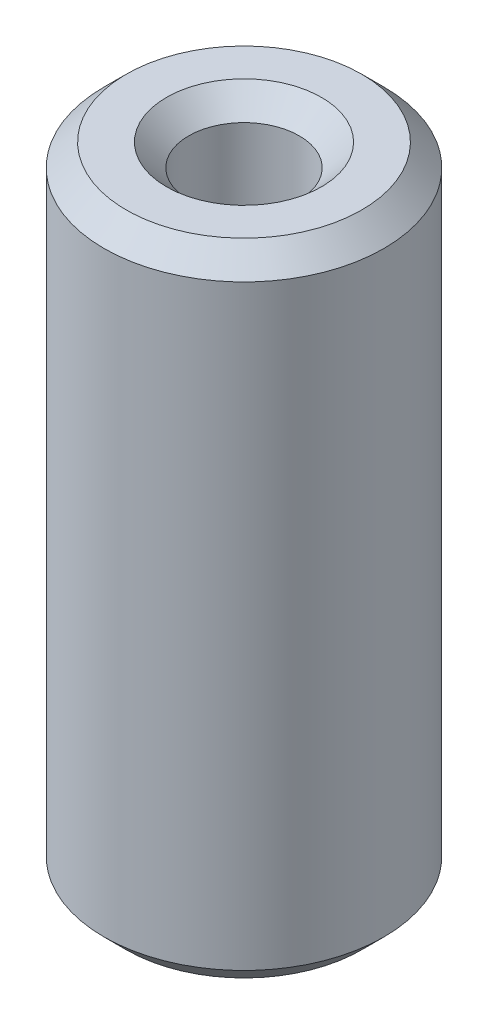
ISO-10303-21;
HEADER;
FILE_DESCRIPTION(('STEP AP214'),'2;1');
FILE_NAME('part.step','',(''),(''),'','','');
FILE_SCHEMA(('AUTOMOTIVE_DESIGN { 1 0 10303 214 1 1 1 1 }'));
ENDSEC;
DATA;
#1=APPLICATION_CONTEXT('core data for automotive mechanical design processes');
#2=APPLICATION_PROTOCOL_DEFINITION('international standard','automotive_design',2000,#1);
#3=PRODUCT_CONTEXT('',#1,'mechanical');
#4=PRODUCT('Part','Part','',(#3));
#5=PRODUCT_RELATED_PRODUCT_CATEGORY('part','',(#4));
#6=PRODUCT_DEFINITION_FORMATION('','',#4);
#7=PRODUCT_DEFINITION_CONTEXT('part definition',#1,'design');
#8=PRODUCT_DEFINITION('design','',#6,#7);
#9=PRODUCT_DEFINITION_SHAPE('','',#8);
#10=(LENGTH_UNIT() NAMED_UNIT(*) SI_UNIT(.MILLI.,.METRE.));
#11=(NAMED_UNIT(*) PLANE_ANGLE_UNIT() SI_UNIT($,.RADIAN.));
#12=(NAMED_UNIT(*) SI_UNIT($,.STERADIAN.) SOLID_ANGLE_UNIT());
#13=UNCERTAINTY_MEASURE_WITH_UNIT(LENGTH_MEASURE(1.E-05),#10,'distance_accuracy_value','');
#14=(GEOMETRIC_REPRESENTATION_CONTEXT(3) GLOBAL_UNCERTAINTY_ASSIGNED_CONTEXT((#13)) GLOBAL_UNIT_ASSIGNED_CONTEXT((#10,
#11,#12)) REPRESENTATION_CONTEXT('',''));
#15=CARTESIAN_POINT('',(0.,0.,0.));
#16=DIRECTION('',(0.,0.,1.));
#17=DIRECTION('',(1.,0.,0.));
#18=AXIS2_PLACEMENT_3D('',#15,#16,#17);
#19=CARTESIAN_POINT('',(0.,45.7951189283596,0.));
#20=DIRECTION('',(0.,-1.,0.));
#21=DIRECTION('',(0.,0.,-1.));
#22=AXIS2_PLACEMENT_3D('',#19,#20,#21);
#23=CYLINDRICAL_SURFACE('',#22,10.);
#24=CARTESIAN_POINT('',(0.,1.58791886390967,0.));
#25=DIRECTION('',(0.,1.,0.));
#26=DIRECTION('',(0.,0.,1.));
#27=AXIS2_PLACEMENT_3D('',#24,#25,#26);
#28=CIRCLE('',#27,10.);
#29=CARTESIAN_POINT('',(0.,1.58791886390967,10.));
#30=VERTEX_POINT('',#29);
#31=EDGE_CURVE('E10',#30,#30,#28,.T.);
#32=ORIENTED_EDGE('',*,*,#31,.T.);
#33=EDGE_LOOP('',(#32));
#34=FACE_BOUND('',#33,.T.);
#35=CARTESIAN_POINT('',(0.,44.2072000644499,0.));
#36=DIRECTION('',(0.,1.,0.));
#37=DIRECTION('',(0.,0.,1.));
#38=AXIS2_PLACEMENT_3D('',#35,#36,#37);
#39=CIRCLE('',#38,10.);
#40=CARTESIAN_POINT('',(0.,44.2072000644499,-10.));
#41=VERTEX_POINT('',#40);
#42=EDGE_CURVE('E50',#41,#41,#39,.F.);
#43=ORIENTED_EDGE('',*,*,#42,.T.);
#44=EDGE_LOOP('',(#43));
#45=FACE_BOUND('',#44,.T.);
#46=ADVANCED_FACE('F39',(#34,#45),#23,.T.);
#47=CARTESIAN_POINT('',(0.,45.7951189283596,0.));
#48=DIRECTION('',(0.,1.,0.));
#49=DIRECTION('',(0.,0.,1.));
#50=AXIS2_PLACEMENT_3D('',#47,#48,#49);
#51=PLANE('',#50);
#52=CARTESIAN_POINT('',(0.,45.7951189283596,0.));
#53=DIRECTION('',(0.,1.,0.));
#54=DIRECTION('',(0.,0.,1.));
#55=AXIS2_PLACEMENT_3D('',#52,#53,#54);
#56=CIRCLE('',#55,5.54028333107635);
#57=CARTESIAN_POINT('',(0.,45.7951189283596,5.54028333107635));
#58=VERTEX_POINT('',#57);
#59=EDGE_CURVE('E58',#58,#58,#56,.F.);
#60=ORIENTED_EDGE('',*,*,#59,.T.);
#61=EDGE_LOOP('',(#60));
#62=FACE_BOUND('',#61,.T.);
#63=CARTESIAN_POINT('',(0.,45.7951189283596,0.));
#64=DIRECTION('',(0.,1.,0.));
#65=DIRECTION('',(0.,0.,1.));
#66=AXIS2_PLACEMENT_3D('',#63,#64,#65);
#67=CIRCLE('',#66,8.41208113609035);
#68=CARTESIAN_POINT('',(0.,45.7951189283596,-8.41208113609035));
#69=VERTEX_POINT('',#68);
#70=EDGE_CURVE('E61',#69,#69,#67,.T.);
#71=ORIENTED_EDGE('',*,*,#70,.T.);
#72=EDGE_LOOP('',(#71));
#73=FACE_BOUND('',#72,.T.);
#74=ADVANCED_FACE('F88',(#62,#73),#51,.T.);
#75=CARTESIAN_POINT('',(0.,0.,0.));
#76=DIRECTION('',(0.,1.,0.));
#77=DIRECTION('',(0.,0.,1.));
#78=AXIS2_PLACEMENT_3D('',#75,#76,#77);
#79=PLANE('',#78);
#80=CARTESIAN_POINT('',(0.,0.,0.));
#81=DIRECTION('',(0.,1.,0.));
#82=DIRECTION('',(0.,0.,1.));
#83=AXIS2_PLACEMENT_3D('',#80,#81,#82);
#84=CIRCLE('',#83,5.54028333107634);
#85=CARTESIAN_POINT('',(0.,0.,-5.54028333107634));
#86=VERTEX_POINT('',#85);
#87=EDGE_CURVE('E51',#86,#86,#84,.T.);
#88=ORIENTED_EDGE('',*,*,#87,.T.);
#89=EDGE_LOOP('',(#88));
#90=FACE_BOUND('',#89,.T.);
#91=CARTESIAN_POINT('',(0.,0.,0.));
#92=DIRECTION('',(0.,1.,0.));
#93=DIRECTION('',(0.,0.,1.));
#94=AXIS2_PLACEMENT_3D('',#91,#92,#93);
#95=CIRCLE('',#94,8.41208113609033);
#96=CARTESIAN_POINT('',(0.,0.,8.41208113609033));
#97=VERTEX_POINT('',#96);
#98=EDGE_CURVE('E54',#97,#97,#95,.F.);
#99=ORIENTED_EDGE('',*,*,#98,.T.);
#100=EDGE_LOOP('',(#99));
#101=FACE_BOUND('',#100,.T.);
#102=ADVANCED_FACE('F83',(#90,#101),#79,.F.);
#103=CARTESIAN_POINT('',(0.,45.7951189283596,0.));
#104=DIRECTION('',(0.,-1.,0.));
#105=DIRECTION('',(0.,0.,-1.));
#106=AXIS2_PLACEMENT_3D('',#103,#104,#105);
#107=CYLINDRICAL_SURFACE('',#106,3.95236446716669);
#108=CARTESIAN_POINT('',(0.,44.20720006445,0.));
#109=DIRECTION('',(0.,1.,0.));
#110=DIRECTION('',(0.,0.,1.));
#111=AXIS2_PLACEMENT_3D('',#108,#109,#110);
#112=CIRCLE('',#111,3.95236446716669);
#113=CARTESIAN_POINT('',(0.,44.20720006445,3.95236446716669));
#114=VERTEX_POINT('',#113);
#115=EDGE_CURVE('E67',#114,#114,#112,.T.);
#116=ORIENTED_EDGE('',*,*,#115,.T.);
#117=EDGE_LOOP('',(#116));
#118=FACE_BOUND('',#117,.T.);
#119=CARTESIAN_POINT('',(0.,1.58791886390966,0.));
#120=DIRECTION('',(0.,1.,0.));
#121=DIRECTION('',(0.,0.,1.));
#122=AXIS2_PLACEMENT_3D('',#119,#120,#121);
#123=CIRCLE('',#122,3.95236446716669);
#124=CARTESIAN_POINT('',(0.,1.58791886390966,-3.95236446716669));
#125=VERTEX_POINT('',#124);
#126=EDGE_CURVE('E69',#125,#125,#123,.F.);
#127=ORIENTED_EDGE('',*,*,#126,.T.);
#128=EDGE_LOOP('',(#127));
#129=FACE_BOUND('',#128,.T.);
#130=ADVANCED_FACE('F71',(#118,#129),#107,.F.);
#131=CARTESIAN_POINT('',(0.,44.20720006445,0.));
#132=DIRECTION('',(0.,1.,0.));
#133=DIRECTION('',(0.,0.,1.));
#134=AXIS2_PLACEMENT_3D('',#131,#132,#133);
#135=CONICAL_SURFACE('',#134,3.95236446716669,0.785398163397453);
#136=ORIENTED_EDGE('',*,*,#59,.F.);
#137=EDGE_LOOP('',(#136));
#138=FACE_BOUND('',#137,.T.);
#139=ORIENTED_EDGE('',*,*,#115,.F.);
#140=EDGE_LOOP('',(#139));
#141=FACE_BOUND('',#140,.T.);
#142=ADVANCED_FACE('F77',(#138,#141),#135,.F.);
#143=CARTESIAN_POINT('',(0.,0.,0.));
#144=DIRECTION('',(0.,-1.,0.));
#145=DIRECTION('',(0.,0.,-1.));
#146=AXIS2_PLACEMENT_3D('',#143,#144,#145);
#147=CONICAL_SURFACE('',#146,5.54028333107634,0.785398163397445);
#148=CARTESIAN_POINT('',(0.,1.58791886390966,-3.95236446716669));
#149=CARTESIAN_POINT('',(0.,1.5713780424106,-3.96890528866575));
#150=CARTESIAN_POINT('',(0.,1.55483722091154,-3.98544611016481));
#151=CARTESIAN_POINT('',(0.,1.52175557791342,-4.01852775316293));
#152=CARTESIAN_POINT('',(0.,1.50521475641436,-4.03506857466199));
#153=CARTESIAN_POINT('',(0.,1.47213311341625,-4.0681502176601));
#154=CARTESIAN_POINT('',(0.,1.45559229191719,-4.08469103915916));
#155=CARTESIAN_POINT('',(0.,1.42251064891907,-4.11777268215728));
#156=CARTESIAN_POINT('',(0.,1.40596982742001,-4.13431350365634));
#157=CARTESIAN_POINT('',(0.,1.37288818442189,-4.16739514665446));
#158=CARTESIAN_POINT('',(0.,1.35634736292283,-4.18393596815352));
#159=CARTESIAN_POINT('',(0.,1.32326571992472,-4.21701761115163));
#160=CARTESIAN_POINT('',(0.,1.30672489842566,-4.23355843265069));
#161=CARTESIAN_POINT('',(0.,1.27364325542754,-4.26664007564881));
#162=CARTESIAN_POINT('',(0.,1.25710243392848,-4.28318089714787));
#163=CARTESIAN_POINT('',(0.,1.22402079093036,-4.31626254014599));
#164=CARTESIAN_POINT('',(0.,1.2074799694313,-4.33280336164504));
#165=CARTESIAN_POINT('',(0.,1.17439832643319,-4.36588500464316));
#166=CARTESIAN_POINT('',(0.,1.15785750493413,-4.38242582614222));
#167=CARTESIAN_POINT('',(0.,1.12477586193601,-4.41550746914034));
#168=CARTESIAN_POINT('',(0.,1.10823504043695,-4.4320482906394));
#169=CARTESIAN_POINT('',(0.,1.07515339743883,-4.46512993363751));
#170=CARTESIAN_POINT('',(0.,1.05861257593977,-4.48167075513657));
#171=CARTESIAN_POINT('',(0.,1.02553093294166,-4.51475239813469));
#172=CARTESIAN_POINT('',(0.,1.0089901114426,-4.53129321963375));
#173=CARTESIAN_POINT('',(0.,0.975908468444478,-4.56437486263187));
#174=CARTESIAN_POINT('',(0.,0.959367646945419,-4.58091568413093));
#175=CARTESIAN_POINT('',(0.,0.926286003947302,-4.61399732712905));
#176=CARTESIAN_POINT('',(0.,0.909745182448242,-4.6305381486281));
#177=CARTESIAN_POINT('',(0.,0.876663539450125,-4.66361979162622));
#178=CARTESIAN_POINT('',(0.,0.860122717951066,-4.68016061312528));
#179=CARTESIAN_POINT('',(0.,0.827041074952948,-4.7132422561234));
#180=CARTESIAN_POINT('',(0.,0.810500253453889,-4.72978307762246));
#181=CARTESIAN_POINT('',(0.,0.777418610455771,-4.76286472062057));
#182=CARTESIAN_POINT('',(0.,0.760877788956712,-4.77940554211963));
#183=CARTESIAN_POINT('',(0.,0.727796145958594,-4.81248718511775));
#184=CARTESIAN_POINT('',(0.,0.711255324459535,-4.82902800661681));
#185=CARTESIAN_POINT('',(0.,0.678173681461417,-4.86210964961493));
#186=CARTESIAN_POINT('',(0.,0.661632859962358,-4.87865047111399));
#187=CARTESIAN_POINT('',(0.,0.62855121696424,-4.9117321141121));
#188=CARTESIAN_POINT('',(0.,0.612010395465181,-4.92827293561116));
#189=CARTESIAN_POINT('',(0.,0.578928752467063,-4.96135457860928));
#190=CARTESIAN_POINT('',(0.,0.562387930968005,-4.97789540010834));
#191=CARTESIAN_POINT('',(0.,0.529306287969887,-5.01097704310646));
#192=CARTESIAN_POINT('',(0.,0.512765466470827,-5.02751786460552));
#193=CARTESIAN_POINT('',(0.,0.47968382347271,-5.06059950760363));
#194=CARTESIAN_POINT('',(0.,0.463143001973651,-5.07714032910269));
#195=CARTESIAN_POINT('',(0.,0.430061358975533,-5.11022197210081));
#196=CARTESIAN_POINT('',(0.,0.413520537476474,-5.12676279359987));
#197=CARTESIAN_POINT('',(0.,0.380438894478356,-5.15984443659799));
#198=CARTESIAN_POINT('',(0.,0.363898072979297,-5.17638525809705));
#199=CARTESIAN_POINT('',(0.,0.330816429981179,-5.20946690109516));
#200=CARTESIAN_POINT('',(0.,0.31427560848212,-5.22600772259422));
#201=CARTESIAN_POINT('',(0.,0.281193965484002,-5.25908936559234));
#202=CARTESIAN_POINT('',(0.,0.264653143984943,-5.2756301870914));
#203=CARTESIAN_POINT('',(0.,0.231571500986825,-5.30871183008952));
#204=CARTESIAN_POINT('',(0.,0.215030679487766,-5.32525265158858));
#205=CARTESIAN_POINT('',(0.,0.181949036489649,-5.35833429458669));
#206=CARTESIAN_POINT('',(0.,0.165408214990589,-5.37487511608575));
#207=CARTESIAN_POINT('',(0.,0.132326571992472,-5.40795675908387));
#208=CARTESIAN_POINT('',(0.,0.115785750493413,-5.42449758058293));
#209=CARTESIAN_POINT('',(0.,0.0827041074952949,-5.45757922358105));
#210=CARTESIAN_POINT('',(0.,0.0661632859962358,-5.4741200450801));
#211=CARTESIAN_POINT('',(0.,0.0330816429981177,-5.50720168807822));
#212=CARTESIAN_POINT('',(0.,0.0165408214990587,-5.52374250957728));
#213=CARTESIAN_POINT('',(0.,0.,-5.54028333107634));
#214=B_SPLINE_CURVE_WITH_KNOTS('',3,(#148,#149,#150,#151,#152,#153,#154,#155,#156,#157,#158,
#159,#160,#161,#162,#163,#164,#165,#166,#167,#168,#169,#170,#171,#172,#173,#174,#175,#176,#177,
#178,#179,#180,#181,#182,#183,#184,#185,#186,#187,#188,#189,#190,#191,#192,#193,#194,#195,#196,
#197,#198,#199,#200,#201,#202,#203,#204,#205,#206,#207,#208,#209,#210,#211,#212,#213),
.UNSPECIFIED.,.F.,.F.,(4,2,2,2,2,2,2,2,2,2,2,2,2,2,2,2,2,2,2,2,2,2,2,2,2,2,2,2,2,2,2,2,4),(0.,
0.0701767622902849,0.140353524580569,0.210530286870854,0.280707049161139,0.350883811451423,
0.421060573741708,0.491237336031993,0.561414098322278,0.631590860612562,0.701767622902847,
0.771944385193132,0.842121147483416,0.912297909773701,0.982474672063985,1.05265143435427,
1.12282819664455,1.19300495893484,1.26318172122512,1.33335848351541,1.40353524580569,
1.47371200809598,1.54388877038626,1.61406553267655,1.68424229496683,1.75441905725712,
1.8245958195474,1.89477258183769,1.96494934412797,2.03512610641826,2.10530286870854,
2.17547963099882,2.24565639328911),.UNSPECIFIED.);
#215=EDGE_CURVE('BSEAM73',#125,#86,#214,.T.);
#216=ORIENTED_EDGE('',*,*,#126,.F.);
#217=ORIENTED_EDGE('',*,*,#87,.F.);
#218=ORIENTED_EDGE('',*,*,#215,.T.);
#219=ORIENTED_EDGE('',*,*,#215,.F.);
#220=EDGE_LOOP('',(#216,#218,#217,#219));
#221=FACE_BOUND('',#220,.T.);
#222=ADVANCED_FACE('F73',(#221),#147,.F.);
#223=CARTESIAN_POINT('',(0.,1.58791886390967,0.));
#224=DIRECTION('',(0.,1.,0.));
#225=DIRECTION('',(0.,0.,1.));
#226=AXIS2_PLACEMENT_3D('',#223,#224,#225);
#227=CONICAL_SURFACE('',#226,10.,0.785398163397452);
#228=ORIENTED_EDGE('',*,*,#98,.F.);
#229=EDGE_LOOP('',(#228));
#230=FACE_BOUND('',#229,.T.);
#231=ORIENTED_EDGE('',*,*,#31,.F.);
#232=EDGE_LOOP('',(#231));
#233=FACE_BOUND('',#232,.T.);
#234=ADVANCED_FACE('F76',(#230,#233),#227,.T.);
#235=CARTESIAN_POINT('',(0.,45.7951189283596,0.));
#236=DIRECTION('',(0.,-1.,0.));
#237=DIRECTION('',(0.,0.,-1.));
#238=AXIS2_PLACEMENT_3D('',#235,#236,#237);
#239=CONICAL_SURFACE('',#238,8.41208113609035,0.785398163397446);
#240=CARTESIAN_POINT('',(0.,44.2072000644499,-10.));
#241=CARTESIAN_POINT('',(0.,44.223740885949,-9.98345917850095));
#242=CARTESIAN_POINT('',(0.,44.2402817074481,-9.96691835700189));
#243=CARTESIAN_POINT('',(0.,44.2733633504462,-9.93383671400377));
#244=CARTESIAN_POINT('',(0.,44.2899041719452,-9.91729589250471));
#245=CARTESIAN_POINT('',(0.,44.3229858149434,-9.88421424950659));
#246=CARTESIAN_POINT('',(0.,44.3395266364424,-9.86767342800754));
#247=CARTESIAN_POINT('',(0.,44.3726082794405,-9.83459178500942));
#248=CARTESIAN_POINT('',(0.,44.3891491009396,-9.81805096351036));
#249=CARTESIAN_POINT('',(0.,44.4222307439377,-9.78496932051224));
#250=CARTESIAN_POINT('',(0.,44.4387715654368,-9.76842849901318));
#251=CARTESIAN_POINT('',(0.,44.4718532084349,-9.73534685601506));
#252=CARTESIAN_POINT('',(0.,44.4883940299339,-9.718806034516));
#253=CARTESIAN_POINT('',(0.,44.5214756729321,-9.68572439151789));
#254=CARTESIAN_POINT('',(0.,44.5380164944311,-9.66918357001883));
#255=CARTESIAN_POINT('',(0.,44.5710981374292,-9.63610192702071));
#256=CARTESIAN_POINT('',(0.,44.5876389589283,-9.61956110552165));
#257=CARTESIAN_POINT('',(0.,44.6207206019264,-9.58647946252353));
#258=CARTESIAN_POINT('',(0.,44.6372614234255,-9.56993864102447));
#259=CARTESIAN_POINT('',(0.,44.6703430664236,-9.53685699802636));
#260=CARTESIAN_POINT('',(0.,44.6868838879227,-9.5203161765273));
#261=CARTESIAN_POINT('',(0.,44.7199655309208,-9.48723453352918));
#262=CARTESIAN_POINT('',(0.,44.7365063524198,-9.47069371203012));
#263=CARTESIAN_POINT('',(0.,44.769587995418,-9.437612069032));
#264=CARTESIAN_POINT('',(0.,44.786128816917,-9.42107124753294));
#265=CARTESIAN_POINT('',(0.,44.8192104599151,-9.38798960453483));
#266=CARTESIAN_POINT('',(0.,44.8357512814142,-9.37144878303577));
#267=CARTESIAN_POINT('',(0.,44.8688329244123,-9.33836714003765));
#268=CARTESIAN_POINT('',(0.,44.8853737459114,-9.32182631853859));
#269=CARTESIAN_POINT('',(0.,44.9184553889095,-9.28874467554047));
#270=CARTESIAN_POINT('',(0.,44.9349962104085,-9.27220385404141));
#271=CARTESIAN_POINT('',(0.,44.9680778534067,-9.2391222110433));
#272=CARTESIAN_POINT('',(0.,44.9846186749057,-9.22258138954424));
#273=CARTESIAN_POINT('',(0.,45.0177003179038,-9.18949974654612));
#274=CARTESIAN_POINT('',(0.,45.0342411394029,-9.17295892504706));
#275=CARTESIAN_POINT('',(0.,45.067322782401,-9.13987728204894));
#276=CARTESIAN_POINT('',(0.,45.0838636039001,-9.12333646054988));
#277=CARTESIAN_POINT('',(0.,45.1169452468982,-9.09025481755177));
#278=CARTESIAN_POINT('',(0.,45.1334860683972,-9.07371399605271));
#279=CARTESIAN_POINT('',(0.,45.1665677113954,-9.04063235305459));
#280=CARTESIAN_POINT('',(0.,45.1831085328944,-9.02409153155553));
#281=CARTESIAN_POINT('',(0.,45.2161901758925,-8.99100988855741));
#282=CARTESIAN_POINT('',(0.,45.2327309973916,-8.97446906705835));
#283=CARTESIAN_POINT('',(0.,45.2658126403897,-8.94138742406024));
#284=CARTESIAN_POINT('',(0.,45.2823534618888,-8.92484660256118));
#285=CARTESIAN_POINT('',(0.,45.3154351048869,-8.89176495956306));
#286=CARTESIAN_POINT('',(0.,45.331975926386,-8.875224138064));
#287=CARTESIAN_POINT('',(0.,45.3650575693841,-8.84214249506588));
#288=CARTESIAN_POINT('',(0.,45.3815983908831,-8.82560167356682));
#289=CARTESIAN_POINT('',(0.,45.4146800338813,-8.79252003056871));
#290=CARTESIAN_POINT('',(0.,45.4312208553803,-8.77597920906965));
#291=CARTESIAN_POINT('',(0.,45.4643024983784,-8.74289756607153));
#292=CARTESIAN_POINT('',(0.,45.4808433198775,-8.72635674457247));
#293=CARTESIAN_POINT('',(0.,45.5139249628756,-8.69327510157435));
#294=CARTESIAN_POINT('',(0.,45.5304657843747,-8.67673428007529));
#295=CARTESIAN_POINT('',(0.,45.5635474273728,-8.64365263707718));
#296=CARTESIAN_POINT('',(0.,45.5800882488718,-8.62711181557812));
#297=CARTESIAN_POINT('',(0.,45.61316989187,-8.59403017258));
#298=CARTESIAN_POINT('',(0.,45.629710713369,-8.57748935108094));
#299=CARTESIAN_POINT('',(0.,45.6627923563671,-8.54440770808282));
#300=CARTESIAN_POINT('',(0.,45.6793331778662,-8.52786688658376));
#301=CARTESIAN_POINT('',(0.,45.7124148208643,-8.49478524358565));
#302=CARTESIAN_POINT('',(0.,45.7289556423634,-8.47824442208659));
#303=CARTESIAN_POINT('',(0.,45.7620372853615,-8.44516277908847));
#304=CARTESIAN_POINT('',(0.,45.7785781068605,-8.42862195758941));
#305=CARTESIAN_POINT('',(0.,45.7951189283596,-8.41208113609035));
#306=B_SPLINE_CURVE_WITH_KNOTS('',3,(#240,#241,#242,#243,#244,#245,#246,#247,#248,#249,#250,
#251,#252,#253,#254,#255,#256,#257,#258,#259,#260,#261,#262,#263,#264,#265,#266,#267,#268,#269,
#270,#271,#272,#273,#274,#275,#276,#277,#278,#279,#280,#281,#282,#283,#284,#285,#286,#287,#288,
#289,#290,#291,#292,#293,#294,#295,#296,#297,#298,#299,#300,#301,#302,#303,#304,#305),
.UNSPECIFIED.,.F.,.F.,(4,2,2,2,2,2,2,2,2,2,2,2,2,2,2,2,2,2,2,2,2,2,2,2,2,2,2,2,2,2,2,2,4),(0.,
0.0701767622902886,0.140353524580572,0.210530286870857,0.280707049161141,0.350883811451426,
0.42106057374171,0.491237336031993,0.561414098322278,0.631590860612567,0.701767622902852,
0.771944385193136,0.842121147483419,0.912297909773704,0.982474672063988,1.05265143435427,
1.12282819664456,1.19300495893485,1.26318172122513,1.33335848351541,1.4035352458057,
1.47371200809598,1.54388877038627,1.61406553267655,1.68424229496684,1.75441905725712,
1.82459581954741,1.89477258183769,1.96494934412798,2.03512610641826,2.10530286870854,
2.17547963099883,2.24565639328912),.UNSPECIFIED.);
#307=EDGE_CURVE('BSEAM45',#41,#69,#306,.T.);
#308=ORIENTED_EDGE('',*,*,#42,.F.);
#309=ORIENTED_EDGE('',*,*,#70,.F.);
#310=ORIENTED_EDGE('',*,*,#307,.T.);
#311=ORIENTED_EDGE('',*,*,#307,.F.);
#312=EDGE_LOOP('',(#308,#310,#309,#311));
#313=FACE_BOUND('',#312,.T.);
#314=ADVANCED_FACE('F45',(#313),#239,.T.);
#315=CLOSED_SHELL('',(#46,#74,#102,#130,#142,#222,#234,#314));
#316=MANIFOLD_SOLID_BREP('B2',#315);
#317=ADVANCED_BREP_SHAPE_REPRESENTATION('',(#18,#316),#14);
#318=SHAPE_DEFINITION_REPRESENTATION(#9,#317);
ENDSEC;
END-ISO-10303-21;
